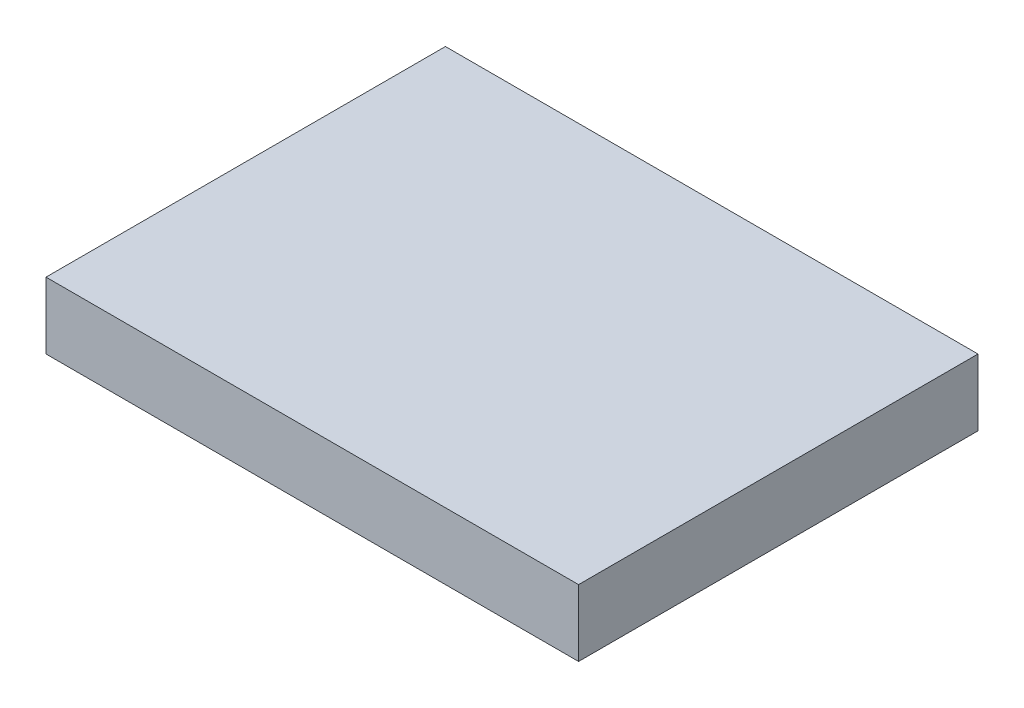
ISO-10303-21;
HEADER;
FILE_DESCRIPTION(('STEP AP214'),'2;1');
FILE_NAME('part.step','',(''),(''),'','','');
FILE_SCHEMA(('AUTOMOTIVE_DESIGN { 1 0 10303 214 1 1 1 1 }'));
ENDSEC;
DATA;
#1=APPLICATION_CONTEXT('core data for automotive mechanical design processes');
#2=APPLICATION_PROTOCOL_DEFINITION('international standard','automotive_design',2000,#1);
#3=PRODUCT_CONTEXT('',#1,'mechanical');
#4=PRODUCT('Part','Part','',(#3));
#5=PRODUCT_RELATED_PRODUCT_CATEGORY('part','',(#4));
#6=PRODUCT_DEFINITION_FORMATION('','',#4);
#7=PRODUCT_DEFINITION_CONTEXT('part definition',#1,'design');
#8=PRODUCT_DEFINITION('design','',#6,#7);
#9=PRODUCT_DEFINITION_SHAPE('','',#8);
#10=(LENGTH_UNIT() NAMED_UNIT(*) SI_UNIT(.MILLI.,.METRE.));
#11=(NAMED_UNIT(*) PLANE_ANGLE_UNIT() SI_UNIT($,.RADIAN.));
#12=(NAMED_UNIT(*) SI_UNIT($,.STERADIAN.) SOLID_ANGLE_UNIT());
#13=UNCERTAINTY_MEASURE_WITH_UNIT(LENGTH_MEASURE(1.E-05),#10,'distance_accuracy_value','');
#14=(GEOMETRIC_REPRESENTATION_CONTEXT(3) GLOBAL_UNCERTAINTY_ASSIGNED_CONTEXT((#13)) GLOBAL_UNIT_ASSIGNED_CONTEXT((#10,
#11,#12)) REPRESENTATION_CONTEXT('',''));
#15=CARTESIAN_POINT('',(0.,0.,0.));
#16=DIRECTION('',(0.,0.,1.));
#17=DIRECTION('',(1.,0.,0.));
#18=AXIS2_PLACEMENT_3D('',#15,#16,#17);
#19=CARTESIAN_POINT('',(24.,1.62,14.56));
#20=DIRECTION('',(0.,1.,0.));
#21=DIRECTION('',(0.,0.,1.));
#22=AXIS2_PLACEMENT_3D('',#19,#20,#21);
#23=PLANE('',#22);
#24=DIRECTION('',(0.,0.,1.));
#25=VECTOR('',#24,1.);
#26=CARTESIAN_POINT('',(23.2,1.62,14.26));
#27=LINE('',#26,#25);
#28=CARTESIAN_POINT('',(23.2,1.62,14.56));
#29=VERTEX_POINT('',#28);
#30=CARTESIAN_POINT('',(23.2,1.62,13.96));
#31=VERTEX_POINT('',#30);
#32=EDGE_CURVE('E55',#29,#31,#27,.F.);
#33=ORIENTED_EDGE('',*,*,#32,.F.);
#34=DIRECTION('',(1.,0.,0.));
#35=VECTOR('',#34,1.);
#36=CARTESIAN_POINT('',(24.,1.62,14.56));
#37=LINE('',#36,#35);
#38=CARTESIAN_POINT('',(24.,1.62,14.56));
#39=VERTEX_POINT('',#38);
#40=EDGE_CURVE('E67',#39,#29,#37,.F.);
#41=ORIENTED_EDGE('',*,*,#40,.F.);
#42=DIRECTION('',(0.,0.,1.));
#43=VECTOR('',#42,1.);
#44=CARTESIAN_POINT('',(24.,1.62,14.26));
#45=LINE('',#44,#43);
#46=CARTESIAN_POINT('',(24.,1.62,13.96));
#47=VERTEX_POINT('',#46);
#48=EDGE_CURVE('E20',#39,#47,#45,.F.);
#49=ORIENTED_EDGE('',*,*,#48,.T.);
#50=DIRECTION('',(-1.,0.,0.));
#51=VECTOR('',#50,1.);
#52=CARTESIAN_POINT('',(24.,1.62,13.96));
#53=LINE('',#52,#51);
#54=EDGE_CURVE('E81',#31,#47,#53,.F.);
#55=ORIENTED_EDGE('',*,*,#54,.F.);
#56=EDGE_LOOP('',(#33,#41,#49,#55));
#57=FACE_BOUND('',#56,.T.);
#58=ADVANCED_FACE('F17',(#57),#23,.T.);
#59=CARTESIAN_POINT('',(24.,1.57,14.26));
#60=DIRECTION('',(-1.,0.,0.));
#61=DIRECTION('',(0.,0.,1.));
#62=AXIS2_PLACEMENT_3D('',#59,#60,#61);
#63=PLANE('',#62);
#64=DIRECTION('',(0.,1.,0.));
#65=VECTOR('',#64,1.);
#66=CARTESIAN_POINT('',(24.,1.52,14.56));
#67=LINE('',#66,#65);
#68=CARTESIAN_POINT('',(24.,1.52,14.56));
#69=VERTEX_POINT('',#68);
#70=EDGE_CURVE('E62',#69,#39,#67,.T.);
#71=ORIENTED_EDGE('',*,*,#70,.F.);
#72=DIRECTION('',(0.,0.,-1.));
#73=VECTOR('',#72,1.);
#74=CARTESIAN_POINT('',(24.,1.52,13.96));
#75=LINE('',#74,#73);
#76=CARTESIAN_POINT('',(24.,1.52,13.96));
#77=VERTEX_POINT('',#76);
#78=EDGE_CURVE('E83',#77,#69,#75,.F.);
#79=ORIENTED_EDGE('',*,*,#78,.F.);
#80=DIRECTION('',(0.,1.,0.));
#81=VECTOR('',#80,1.);
#82=CARTESIAN_POINT('',(24.,1.62,13.96));
#83=LINE('',#82,#81);
#84=EDGE_CURVE('E65',#47,#77,#83,.F.);
#85=ORIENTED_EDGE('',*,*,#84,.F.);
#86=ORIENTED_EDGE('',*,*,#48,.F.);
#87=EDGE_LOOP('',(#71,#79,#85,#86));
#88=FACE_BOUND('',#87,.T.);
#89=ADVANCED_FACE('F60',(#88),#63,.F.);
#90=CARTESIAN_POINT('',(24.,1.52,14.56));
#91=DIRECTION('',(0.,0.,1.));
#92=DIRECTION('',(1.,0.,0.));
#93=AXIS2_PLACEMENT_3D('',#90,#91,#92);
#94=PLANE('',#93);
#95=DIRECTION('',(0.,1.,0.));
#96=VECTOR('',#95,1.);
#97=CARTESIAN_POINT('',(23.2,1.57,14.56));
#98=LINE('',#97,#96);
#99=CARTESIAN_POINT('',(23.2,1.52,14.56));
#100=VERTEX_POINT('',#99);
#101=EDGE_CURVE('E77',#100,#29,#98,.T.);
#102=ORIENTED_EDGE('',*,*,#101,.F.);
#103=DIRECTION('',(1.,0.,0.));
#104=VECTOR('',#103,1.);
#105=CARTESIAN_POINT('',(24.,1.52,14.56));
#106=LINE('',#105,#104);
#107=EDGE_CURVE('E73',#69,#100,#106,.F.);
#108=ORIENTED_EDGE('',*,*,#107,.F.);
#109=ORIENTED_EDGE('',*,*,#70,.T.);
#110=ORIENTED_EDGE('',*,*,#40,.T.);
#111=EDGE_LOOP('',(#102,#108,#109,#110));
#112=FACE_BOUND('',#111,.T.);
#113=ADVANCED_FACE('F71',(#112),#94,.T.);
#114=CARTESIAN_POINT('',(23.2,1.57,14.26));
#115=DIRECTION('',(-1.,0.,0.));
#116=DIRECTION('',(0.,0.,1.));
#117=AXIS2_PLACEMENT_3D('',#114,#115,#116);
#118=PLANE('',#117);
#119=DIRECTION('',(0.,0.,-1.));
#120=VECTOR('',#119,1.);
#121=CARTESIAN_POINT('',(23.2,1.52,13.96));
#122=LINE('',#121,#120);
#123=CARTESIAN_POINT('',(23.2,1.52,13.96));
#124=VERTEX_POINT('',#123);
#125=EDGE_CURVE('E26',#100,#124,#122,.T.);
#126=ORIENTED_EDGE('',*,*,#125,.F.);
#127=ORIENTED_EDGE('',*,*,#101,.T.);
#128=ORIENTED_EDGE('',*,*,#32,.T.);
#129=DIRECTION('',(0.,1.,0.));
#130=VECTOR('',#129,1.);
#131=CARTESIAN_POINT('',(23.2,1.62,13.96));
#132=LINE('',#131,#130);
#133=EDGE_CURVE('E35',#124,#31,#132,.T.);
#134=ORIENTED_EDGE('',*,*,#133,.F.);
#135=EDGE_LOOP('',(#126,#127,#128,#134));
#136=FACE_BOUND('',#135,.T.);
#137=ADVANCED_FACE('F89',(#136),#118,.T.);
#138=CARTESIAN_POINT('',(24.,1.62,13.96));
#139=DIRECTION('',(0.,0.,-1.));
#140=DIRECTION('',(-1.,0.,0.));
#141=AXIS2_PLACEMENT_3D('',#138,#139,#140);
#142=PLANE('',#141);
#143=ORIENTED_EDGE('',*,*,#133,.T.);
#144=ORIENTED_EDGE('',*,*,#54,.T.);
#145=ORIENTED_EDGE('',*,*,#84,.T.);
#146=DIRECTION('',(1.,0.,0.));
#147=VECTOR('',#146,1.);
#148=CARTESIAN_POINT('',(24.,1.52,13.96));
#149=LINE('',#148,#147);
#150=EDGE_CURVE('E11',#124,#77,#149,.T.);
#151=ORIENTED_EDGE('',*,*,#150,.F.);
#152=EDGE_LOOP('',(#143,#144,#145,#151));
#153=FACE_BOUND('',#152,.T.);
#154=ADVANCED_FACE('F91',(#153),#142,.T.);
#155=CARTESIAN_POINT('',(24.,1.52,13.96));
#156=DIRECTION('',(0.,-1.,0.));
#157=DIRECTION('',(0.,0.,-1.));
#158=AXIS2_PLACEMENT_3D('',#155,#156,#157);
#159=PLANE('',#158);
#160=ORIENTED_EDGE('',*,*,#125,.T.);
#161=ORIENTED_EDGE('',*,*,#150,.T.);
#162=ORIENTED_EDGE('',*,*,#78,.T.);
#163=ORIENTED_EDGE('',*,*,#107,.T.);
#164=EDGE_LOOP('',(#160,#161,#162,#163));
#165=FACE_BOUND('',#164,.T.);
#166=ADVANCED_FACE('F88',(#165),#159,.T.);
#167=CLOSED_SHELL('',(#58,#89,#113,#137,#154,#166));
#168=MANIFOLD_SOLID_BREP('B1',#167);
#169=ADVANCED_BREP_SHAPE_REPRESENTATION('',(#18,#168),#14);
#170=SHAPE_DEFINITION_REPRESENTATION(#9,#169);
ENDSEC;
END-ISO-10303-21;
